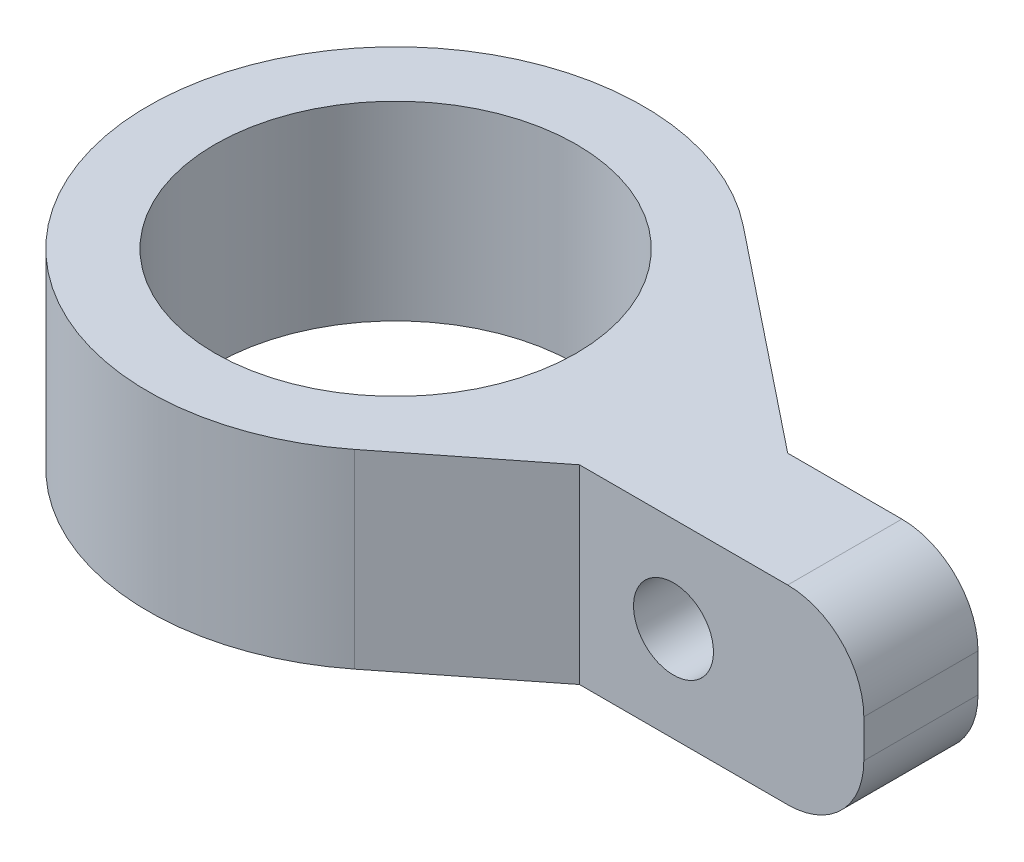
ISO-10303-21;
HEADER;
FILE_DESCRIPTION(('STEP AP214'),'2;1');
FILE_NAME('part.step','',(''),(''),'','','');
FILE_SCHEMA(('AUTOMOTIVE_DESIGN { 1 0 10303 214 1 1 1 1 }'));
ENDSEC;
DATA;
#1=APPLICATION_CONTEXT('core data for automotive mechanical design processes');
#2=APPLICATION_PROTOCOL_DEFINITION('international standard','automotive_design',2000,#1);
#3=PRODUCT_CONTEXT('',#1,'mechanical');
#4=PRODUCT('Part','Part','',(#3));
#5=PRODUCT_RELATED_PRODUCT_CATEGORY('part','',(#4));
#6=PRODUCT_DEFINITION_FORMATION('','',#4);
#7=PRODUCT_DEFINITION_CONTEXT('part definition',#1,'design');
#8=PRODUCT_DEFINITION('design','',#6,#7);
#9=PRODUCT_DEFINITION_SHAPE('','',#8);
#10=(LENGTH_UNIT() NAMED_UNIT(*) SI_UNIT(.MILLI.,.METRE.));
#11=(NAMED_UNIT(*) PLANE_ANGLE_UNIT() SI_UNIT($,.RADIAN.));
#12=(NAMED_UNIT(*) SI_UNIT($,.STERADIAN.) SOLID_ANGLE_UNIT());
#13=UNCERTAINTY_MEASURE_WITH_UNIT(LENGTH_MEASURE(1.E-05),#10,'distance_accuracy_value','');
#14=(GEOMETRIC_REPRESENTATION_CONTEXT(3) GLOBAL_UNCERTAINTY_ASSIGNED_CONTEXT((#13)) GLOBAL_UNIT_ASSIGNED_CONTEXT((#10,
#11,#12)) REPRESENTATION_CONTEXT('',''));
#15=CARTESIAN_POINT('',(0.,0.,0.));
#16=DIRECTION('',(0.,0.,1.));
#17=DIRECTION('',(1.,0.,0.));
#18=AXIS2_PLACEMENT_3D('',#15,#16,#17);
#19=CARTESIAN_POINT('',(-9.8,2.5,0.5));
#20=DIRECTION('',(0.,-1.,0.));
#21=DIRECTION('',(0.,0.,-1.));
#22=AXIS2_PLACEMENT_3D('',#19,#20,#21);
#23=CYLINDRICAL_SURFACE('',#22,6.5);
#24=CARTESIAN_POINT('',(-9.8,2.5,0.5));
#25=DIRECTION('',(0.,1.,0.));
#26=DIRECTION('',(0.,0.,1.));
#27=AXIS2_PLACEMENT_3D('',#24,#25,#26);
#28=CIRCLE('',#27,6.5);
#29=CARTESIAN_POINT('',(-5.74808774259358,2.5,-4.58251975483417));
#30=VERTEX_POINT('',#29);
#31=CARTESIAN_POINT('',(-5.7771101899574,2.5,5.60552226283026));
#32=VERTEX_POINT('',#31);
#33=EDGE_CURVE('E11',#30,#32,#28,.T.);
#34=ORIENTED_EDGE('',*,*,#33,.F.);
#35=DIRECTION('',(0.,-1.,0.));
#36=VECTOR('',#35,1.);
#37=CARTESIAN_POINT('',(-5.74808774259358,9.85119037979564,-4.58251975483417));
#38=LINE('',#37,#36);
#39=CARTESIAN_POINT('',(-5.74808774259358,-2.5,-4.58251975483417));
#40=VERTEX_POINT('',#39);
#41=EDGE_CURVE('E109',#30,#40,#38,.T.);
#42=ORIENTED_EDGE('',*,*,#41,.T.);
#43=CARTESIAN_POINT('',(-9.8,-2.5,0.5));
#44=DIRECTION('',(0.,1.,0.));
#45=DIRECTION('',(0.,0.,1.));
#46=AXIS2_PLACEMENT_3D('',#43,#44,#45);
#47=CIRCLE('',#46,6.5);
#48=CARTESIAN_POINT('',(-5.7771101899574,-2.5,5.60552226283026));
#49=VERTEX_POINT('',#48);
#50=EDGE_CURVE('E42',#40,#49,#47,.T.);
#51=ORIENTED_EDGE('',*,*,#50,.T.);
#52=DIRECTION('',(0.,-1.,0.));
#53=VECTOR('',#52,1.);
#54=CARTESIAN_POINT('',(-5.7771101899574,9.85119037979564,5.60552226283026));
#55=LINE('',#54,#53);
#56=EDGE_CURVE('E177',#32,#49,#55,.T.);
#57=ORIENTED_EDGE('',*,*,#56,.F.);
#58=EDGE_LOOP('',(#34,#42,#51,#57));
#59=FACE_BOUND('',#58,.T.);
#60=ADVANCED_FACE('F39',(#59),#23,.T.);
#61=CARTESIAN_POINT('',(-9.8,2.5,0.5));
#62=DIRECTION('',(0.,1.,0.));
#63=DIRECTION('',(0.,0.,1.));
#64=AXIS2_PLACEMENT_3D('',#61,#62,#63);
#65=PLANE('',#64);
#66=DIRECTION('',(0.781926116128334,0.,0.623371116524065));
#67=VECTOR('',#66,1.);
#68=CARTESIAN_POINT('',(-5.74808774259358,2.5,-4.58251975483417));
#69=LINE('',#68,#67);
#70=CARTESIAN_POINT('',(0.,2.5,0.));
#71=VERTEX_POINT('',#70);
#72=EDGE_CURVE('E54',#30,#71,#69,.T.);
#73=ORIENTED_EDGE('',*,*,#72,.F.);
#74=ORIENTED_EDGE('',*,*,#33,.T.);
#75=DIRECTION('',(-0.785464963512348,0.,0.618906124621938));
#76=VECTOR('',#75,1.);
#77=CARTESIAN_POINT('',(-5.7771101899574,2.5,5.60552226283026));
#78=LINE('',#77,#76);
#79=CARTESIAN_POINT('',(-2.47039473233494,2.5,3.));
#80=VERTEX_POINT('',#79);
#81=EDGE_CURVE('E173',#80,#32,#78,.T.);
#82=ORIENTED_EDGE('',*,*,#81,.F.);
#83=DIRECTION('',(-1.,0.,0.));
#84=VECTOR('',#83,1.);
#85=CARTESIAN_POINT('',(5.,2.5,3.));
#86=LINE('',#85,#84);
#87=CARTESIAN_POINT('',(3.,2.5,3.));
#88=VERTEX_POINT('',#87);
#89=EDGE_CURVE('E138',#88,#80,#86,.T.);
#90=ORIENTED_EDGE('',*,*,#89,.F.);
#91=DIRECTION('',(0.,0.,-1.));
#92=VECTOR('',#91,1.);
#93=CARTESIAN_POINT('',(3.,2.5,3.));
#94=LINE('',#93,#92);
#95=CARTESIAN_POINT('',(3.,2.5,0.));
#96=VERTEX_POINT('',#95);
#97=EDGE_CURVE('E165',#88,#96,#94,.T.);
#98=ORIENTED_EDGE('',*,*,#97,.T.);
#99=DIRECTION('',(-1.,0.,0.));
#100=VECTOR('',#99,1.);
#101=CARTESIAN_POINT('',(5.,2.5,0.));
#102=LINE('',#101,#100);
#103=EDGE_CURVE('E132',#96,#71,#102,.T.);
#104=ORIENTED_EDGE('',*,*,#103,.T.);
#105=EDGE_LOOP('',(#73,#74,#82,#90,#98,#104));
#106=FACE_BOUND('',#105,.T.);
#107=CARTESIAN_POINT('',(-9.8,2.5,0.5));
#108=DIRECTION('',(0.,-1.,0.));
#109=DIRECTION('',(0.,0.,-1.));
#110=AXIS2_PLACEMENT_3D('',#107,#108,#109);
#111=CIRCLE('',#110,4.75);
#112=CARTESIAN_POINT('',(-9.8,2.5,-4.25));
#113=VERTEX_POINT('',#112);
#114=EDGE_CURVE('E185',#113,#113,#111,.T.);
#115=ORIENTED_EDGE('',*,*,#114,.T.);
#116=EDGE_LOOP('',(#115));
#117=FACE_BOUND('',#116,.T.);
#118=ADVANCED_FACE('F195',(#106,#117),#65,.T.);
#119=CARTESIAN_POINT('',(-9.8,-2.5,0.5));
#120=DIRECTION('',(0.,1.,0.));
#121=DIRECTION('',(0.,0.,1.));
#122=AXIS2_PLACEMENT_3D('',#119,#120,#121);
#123=PLANE('',#122);
#124=ORIENTED_EDGE('',*,*,#50,.F.);
#125=DIRECTION('',(0.781926116128334,0.,0.623371116524065));
#126=VECTOR('',#125,1.);
#127=CARTESIAN_POINT('',(-5.74808774259358,-2.5,-4.58251975483417));
#128=LINE('',#127,#126);
#129=CARTESIAN_POINT('',(0.,-2.5,0.));
#130=VERTEX_POINT('',#129);
#131=EDGE_CURVE('E102',#40,#130,#128,.T.);
#132=ORIENTED_EDGE('',*,*,#131,.T.);
#133=DIRECTION('',(1.,0.,0.));
#134=VECTOR('',#133,1.);
#135=CARTESIAN_POINT('',(5.,-2.5,0.));
#136=LINE('',#135,#134);
#137=CARTESIAN_POINT('',(3.,-2.5,0.));
#138=VERTEX_POINT('',#137);
#139=EDGE_CURVE('E116',#130,#138,#136,.T.);
#140=ORIENTED_EDGE('',*,*,#139,.T.);
#141=DIRECTION('',(0.,0.,-1.));
#142=VECTOR('',#141,1.);
#143=CARTESIAN_POINT('',(3.,-2.5,3.));
#144=LINE('',#143,#142);
#145=CARTESIAN_POINT('',(3.,-2.5,3.));
#146=VERTEX_POINT('',#145);
#147=EDGE_CURVE('E156',#138,#146,#144,.F.);
#148=ORIENTED_EDGE('',*,*,#147,.T.);
#149=DIRECTION('',(1.,0.,0.));
#150=VECTOR('',#149,1.);
#151=CARTESIAN_POINT('',(5.,-2.5,3.));
#152=LINE('',#151,#150);
#153=CARTESIAN_POINT('',(-2.47039473233494,-2.5,3.));
#154=VERTEX_POINT('',#153);
#155=EDGE_CURVE('E143',#154,#146,#152,.T.);
#156=ORIENTED_EDGE('',*,*,#155,.F.);
#157=DIRECTION('',(-0.785464963512348,0.,0.618906124621938));
#158=VECTOR('',#157,1.);
#159=CARTESIAN_POINT('',(-5.7771101899574,-2.5,5.60552226283026));
#160=LINE('',#159,#158);
#161=EDGE_CURVE('E169',#154,#49,#160,.T.);
#162=ORIENTED_EDGE('',*,*,#161,.T.);
#163=EDGE_LOOP('',(#124,#132,#140,#148,#156,#162));
#164=FACE_BOUND('',#163,.T.);
#165=CARTESIAN_POINT('',(-9.8,-2.5,0.5));
#166=DIRECTION('',(0.,-1.,0.));
#167=DIRECTION('',(0.,0.,-1.));
#168=AXIS2_PLACEMENT_3D('',#165,#166,#167);
#169=CIRCLE('',#168,4.75);
#170=CARTESIAN_POINT('',(-9.8,-2.5,-4.25));
#171=VERTEX_POINT('',#170);
#172=EDGE_CURVE('E181',#171,#171,#169,.T.);
#173=ORIENTED_EDGE('',*,*,#172,.F.);
#174=EDGE_LOOP('',(#173));
#175=FACE_BOUND('',#174,.T.);
#176=ADVANCED_FACE('F113',(#164,#175),#123,.F.);
#177=CARTESIAN_POINT('',(-9.8,2.5,0.5));
#178=DIRECTION('',(0.,-1.,0.));
#179=DIRECTION('',(0.,0.,-1.));
#180=AXIS2_PLACEMENT_3D('',#177,#178,#179);
#181=CYLINDRICAL_SURFACE('',#180,4.75);
#182=ORIENTED_EDGE('',*,*,#114,.F.);
#183=EDGE_LOOP('',(#182));
#184=FACE_BOUND('',#183,.T.);
#185=ORIENTED_EDGE('',*,*,#172,.T.);
#186=EDGE_LOOP('',(#185));
#187=FACE_BOUND('',#186,.T.);
#188=ADVANCED_FACE('F193',(#184,#187),#181,.F.);
#189=CARTESIAN_POINT('',(-5.7771101899574,9.85119037979564,5.60552226283026));
#190=DIRECTION('',(0.618906124621938,0.,0.785464963512348));
#191=DIRECTION('',(0.785464963512348,0.,-0.618906124621938));
#192=AXIS2_PLACEMENT_3D('',#189,#190,#191);
#193=PLANE('',#192);
#194=DIRECTION('',(0.,-1.,0.));
#195=VECTOR('',#194,1.);
#196=CARTESIAN_POINT('',(-2.47039473233494,9.85119037979564,3.));
#197=LINE('',#196,#195);
#198=EDGE_CURVE('E172',#80,#154,#197,.T.);
#199=ORIENTED_EDGE('',*,*,#198,.F.);
#200=ORIENTED_EDGE('',*,*,#81,.T.);
#201=ORIENTED_EDGE('',*,*,#56,.T.);
#202=ORIENTED_EDGE('',*,*,#161,.F.);
#203=EDGE_LOOP('',(#199,#200,#201,#202));
#204=FACE_BOUND('',#203,.T.);
#205=ADVANCED_FACE('F200',(#204),#193,.T.);
#206=CARTESIAN_POINT('',(0.,0.,0.));
#207=DIRECTION('',(0.,0.,1.));
#208=DIRECTION('',(1.,0.,0.));
#209=AXIS2_PLACEMENT_3D('',#206,#207,#208);
#210=PLANE('',#209);
#211=ORIENTED_EDGE('',*,*,#139,.F.);
#212=DIRECTION('',(0.,-1.,0.));
#213=VECTOR('',#212,1.);
#214=CARTESIAN_POINT('',(0.,9.85119037979564,0.));
#215=LINE('',#214,#213);
#216=EDGE_CURVE('E99',#71,#130,#215,.T.);
#217=ORIENTED_EDGE('',*,*,#216,.F.);
#218=ORIENTED_EDGE('',*,*,#103,.F.);
#219=CARTESIAN_POINT('',(3.,0.5,0.));
#220=DIRECTION('',(0.,0.,1.));
#221=DIRECTION('',(1.,0.,0.));
#222=AXIS2_PLACEMENT_3D('',#219,#220,#221);
#223=CIRCLE('',#222,2.);
#224=CARTESIAN_POINT('',(5.,0.5,0.));
#225=VERTEX_POINT('',#224);
#226=EDGE_CURVE('E151',#96,#225,#223,.F.);
#227=ORIENTED_EDGE('',*,*,#226,.T.);
#228=DIRECTION('',(0.,1.,0.));
#229=VECTOR('',#228,1.);
#230=CARTESIAN_POINT('',(5.,-2.5,0.));
#231=LINE('',#230,#229);
#232=CARTESIAN_POINT('',(5.,-0.5,0.));
#233=VERTEX_POINT('',#232);
#234=EDGE_CURVE('E126',#233,#225,#231,.T.);
#235=ORIENTED_EDGE('',*,*,#234,.F.);
#236=CARTESIAN_POINT('',(3.,-0.5,0.));
#237=DIRECTION('',(0.,0.,1.));
#238=DIRECTION('',(1.,0.,0.));
#239=AXIS2_PLACEMENT_3D('',#236,#237,#238);
#240=CIRCLE('',#239,2.);
#241=EDGE_CURVE('E123',#233,#138,#240,.F.);
#242=ORIENTED_EDGE('',*,*,#241,.T.);
#243=EDGE_LOOP('',(#211,#217,#218,#227,#235,#242));
#244=FACE_BOUND('',#243,.T.);
#245=ADVANCED_FACE('F121',(#244),#210,.F.);
#246=CARTESIAN_POINT('',(5.,-2.5,3.));
#247=DIRECTION('',(-1.,0.,0.));
#248=DIRECTION('',(0.,0.,1.));
#249=AXIS2_PLACEMENT_3D('',#246,#247,#248);
#250=PLANE('',#249);
#251=DIRECTION('',(0.,1.,0.));
#252=VECTOR('',#251,1.);
#253=CARTESIAN_POINT('',(5.,-2.5,3.));
#254=LINE('',#253,#252);
#255=CARTESIAN_POINT('',(5.,-0.5,3.));
#256=VERTEX_POINT('',#255);
#257=CARTESIAN_POINT('',(5.,0.5,3.));
#258=VERTEX_POINT('',#257);
#259=EDGE_CURVE('E216',#256,#258,#254,.T.);
#260=ORIENTED_EDGE('',*,*,#259,.F.);
#261=DIRECTION('',(0.,0.,-1.));
#262=VECTOR('',#261,1.);
#263=CARTESIAN_POINT('',(5.,-0.5,3.));
#264=LINE('',#263,#262);
#265=EDGE_CURVE('E147',#256,#233,#264,.T.);
#266=ORIENTED_EDGE('',*,*,#265,.T.);
#267=ORIENTED_EDGE('',*,*,#234,.T.);
#268=DIRECTION('',(0.,0.,-1.));
#269=VECTOR('',#268,1.);
#270=CARTESIAN_POINT('',(5.,0.5,3.));
#271=LINE('',#270,#269);
#272=EDGE_CURVE('E144',#225,#258,#271,.F.);
#273=ORIENTED_EDGE('',*,*,#272,.T.);
#274=EDGE_LOOP('',(#260,#266,#267,#273));
#275=FACE_BOUND('',#274,.T.);
#276=ADVANCED_FACE('F223',(#275),#250,.F.);
#277=CARTESIAN_POINT('',(0.,0.,3.));
#278=DIRECTION('',(0.,0.,1.));
#279=DIRECTION('',(1.,0.,0.));
#280=AXIS2_PLACEMENT_3D('',#277,#278,#279);
#281=PLANE('',#280);
#282=CARTESIAN_POINT('',(0.,0.,3.));
#283=DIRECTION('',(0.,0.,1.));
#284=DIRECTION('',(1.,0.,0.));
#285=AXIS2_PLACEMENT_3D('',#282,#283,#284);
#286=CIRCLE('',#285,1.05);
#287=CARTESIAN_POINT('',(1.05,0.,3.));
#288=VERTEX_POINT('',#287);
#289=EDGE_CURVE('E135',#288,#288,#286,.T.);
#290=ORIENTED_EDGE('',*,*,#289,.F.);
#291=EDGE_LOOP('',(#290));
#292=FACE_BOUND('',#291,.T.);
#293=ORIENTED_EDGE('',*,*,#89,.T.);
#294=ORIENTED_EDGE('',*,*,#198,.T.);
#295=ORIENTED_EDGE('',*,*,#155,.T.);
#296=CARTESIAN_POINT('',(3.,-0.5,3.));
#297=DIRECTION('',(0.,0.,1.));
#298=DIRECTION('',(1.,0.,0.));
#299=AXIS2_PLACEMENT_3D('',#296,#297,#298);
#300=CIRCLE('',#299,2.);
#301=EDGE_CURVE('E162',#146,#256,#300,.T.);
#302=ORIENTED_EDGE('',*,*,#301,.T.);
#303=ORIENTED_EDGE('',*,*,#259,.T.);
#304=CARTESIAN_POINT('',(3.,0.5,3.));
#305=DIRECTION('',(0.,0.,1.));
#306=DIRECTION('',(1.,0.,0.));
#307=AXIS2_PLACEMENT_3D('',#304,#305,#306);
#308=CIRCLE('',#307,2.);
#309=EDGE_CURVE('E159',#258,#88,#308,.T.);
#310=ORIENTED_EDGE('',*,*,#309,.T.);
#311=EDGE_LOOP('',(#293,#294,#295,#302,#303,#310));
#312=FACE_BOUND('',#311,.T.);
#313=ADVANCED_FACE('F244',(#292,#312),#281,.T.);
#314=CARTESIAN_POINT('',(3.,-0.5,3.));
#315=DIRECTION('',(0.,0.,-1.));
#316=DIRECTION('',(-1.,0.,0.));
#317=AXIS2_PLACEMENT_3D('',#314,#315,#316);
#318=CYLINDRICAL_SURFACE('',#317,2.);
#319=ORIENTED_EDGE('',*,*,#301,.F.);
#320=ORIENTED_EDGE('',*,*,#147,.F.);
#321=ORIENTED_EDGE('',*,*,#241,.F.);
#322=ORIENTED_EDGE('',*,*,#265,.F.);
#323=EDGE_LOOP('',(#319,#320,#321,#322));
#324=FACE_BOUND('',#323,.T.);
#325=ADVANCED_FACE('F228',(#324),#318,.T.);
#326=CARTESIAN_POINT('',(3.,0.5,3.));
#327=DIRECTION('',(0.,0.,-1.));
#328=DIRECTION('',(-1.,0.,0.));
#329=AXIS2_PLACEMENT_3D('',#326,#327,#328);
#330=CYLINDRICAL_SURFACE('',#329,2.);
#331=ORIENTED_EDGE('',*,*,#309,.F.);
#332=ORIENTED_EDGE('',*,*,#272,.F.);
#333=ORIENTED_EDGE('',*,*,#226,.F.);
#334=ORIENTED_EDGE('',*,*,#97,.F.);
#335=EDGE_LOOP('',(#331,#332,#333,#334));
#336=FACE_BOUND('',#335,.T.);
#337=ADVANCED_FACE('F219',(#336),#330,.T.);
#338=CARTESIAN_POINT('',(0.,0.,1.));
#339=DIRECTION('',(0.,0.,1.));
#340=DIRECTION('',(1.,0.,0.));
#341=AXIS2_PLACEMENT_3D('',#338,#339,#340);
#342=CYLINDRICAL_SURFACE('',#341,1.05);
#343=CARTESIAN_POINT('',(0.,0.,1.));
#344=DIRECTION('',(0.,0.,1.));
#345=DIRECTION('',(1.,0.,0.));
#346=AXIS2_PLACEMENT_3D('',#343,#344,#345);
#347=CIRCLE('',#346,1.05);
#348=CARTESIAN_POINT('',(1.05,0.,1.));
#349=VERTEX_POINT('',#348);
#350=EDGE_CURVE('E127',#349,#349,#347,.T.);
#351=ORIENTED_EDGE('',*,*,#350,.F.);
#352=EDGE_LOOP('',(#351));
#353=FACE_BOUND('',#352,.T.);
#354=ORIENTED_EDGE('',*,*,#289,.T.);
#355=EDGE_LOOP('',(#354));
#356=FACE_BOUND('',#355,.T.);
#357=ADVANCED_FACE('F242',(#353,#356),#342,.F.);
#358=CARTESIAN_POINT('',(0.,0.,1.));
#359=DIRECTION('',(0.,0.,1.));
#360=DIRECTION('',(1.,0.,0.));
#361=AXIS2_PLACEMENT_3D('',#358,#359,#360);
#362=PLANE('',#361);
#363=ORIENTED_EDGE('',*,*,#350,.T.);
#364=EDGE_LOOP('',(#363));
#365=FACE_BOUND('',#364,.T.);
#366=ADVANCED_FACE('F298',(#365),#362,.T.);
#367=CARTESIAN_POINT('',(-5.74808774259358,9.85119037979564,-4.58251975483417));
#368=DIRECTION('',(0.623371116524065,0.,-0.781926116128334));
#369=DIRECTION('',(-0.781926116128334,0.,-0.623371116524065));
#370=AXIS2_PLACEMENT_3D('',#367,#368,#369);
#371=PLANE('',#370);
#372=ORIENTED_EDGE('',*,*,#41,.F.);
#373=ORIENTED_EDGE('',*,*,#72,.T.);
#374=ORIENTED_EDGE('',*,*,#216,.T.);
#375=ORIENTED_EDGE('',*,*,#131,.F.);
#376=EDGE_LOOP('',(#372,#373,#374,#375));
#377=FACE_BOUND('',#376,.T.);
#378=ADVANCED_FACE('F101',(#377),#371,.T.);
#379=CLOSED_SHELL('',(#60,#118,#176,#188,#205,#245,#276,#313,#325,#337,#357,#366,#378));
#380=MANIFOLD_SOLID_BREP('B2',#379);
#381=ADVANCED_BREP_SHAPE_REPRESENTATION('',(#18,#380),#14);
#382=SHAPE_DEFINITION_REPRESENTATION(#9,#381);
ENDSEC;
END-ISO-10303-21;
